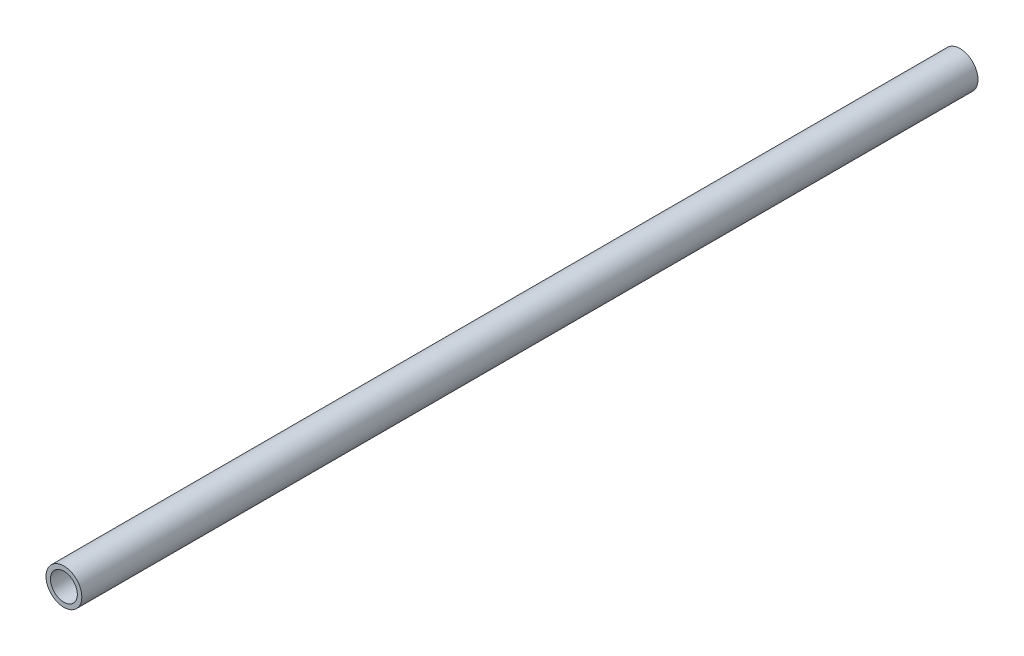
ISO-10303-21;
HEADER;
FILE_DESCRIPTION(('STEP AP214'),'2;1');
FILE_NAME('part.step','',(''),(''),'','','');
FILE_SCHEMA(('AUTOMOTIVE_DESIGN { 1 0 10303 214 1 1 1 1 }'));
ENDSEC;
DATA;
#1=APPLICATION_CONTEXT('core data for automotive mechanical design processes');
#2=APPLICATION_PROTOCOL_DEFINITION('international standard','automotive_design',2000,#1);
#3=PRODUCT_CONTEXT('',#1,'mechanical');
#4=PRODUCT('Part','Part','',(#3));
#5=PRODUCT_RELATED_PRODUCT_CATEGORY('part','',(#4));
#6=PRODUCT_DEFINITION_FORMATION('','',#4);
#7=PRODUCT_DEFINITION_CONTEXT('part definition',#1,'design');
#8=PRODUCT_DEFINITION('design','',#6,#7);
#9=PRODUCT_DEFINITION_SHAPE('','',#8);
#10=(LENGTH_UNIT() NAMED_UNIT(*) SI_UNIT(.MILLI.,.METRE.));
#11=(NAMED_UNIT(*) PLANE_ANGLE_UNIT() SI_UNIT($,.RADIAN.));
#12=(NAMED_UNIT(*) SI_UNIT($,.STERADIAN.) SOLID_ANGLE_UNIT());
#13=UNCERTAINTY_MEASURE_WITH_UNIT(LENGTH_MEASURE(1.E-05),#10,'distance_accuracy_value','');
#14=(GEOMETRIC_REPRESENTATION_CONTEXT(3) GLOBAL_UNCERTAINTY_ASSIGNED_CONTEXT((#13)) GLOBAL_UNIT_ASSIGNED_CONTEXT((#10,
#11,#12)) REPRESENTATION_CONTEXT('',''));
#15=CARTESIAN_POINT('',(0.,0.,0.));
#16=DIRECTION('',(0.,0.,1.));
#17=DIRECTION('',(1.,0.,0.));
#18=AXIS2_PLACEMENT_3D('',#15,#16,#17);
#19=CARTESIAN_POINT('',(0.,0.,635.));
#20=DIRECTION('',(0.,0.,1.));
#21=DIRECTION('',(1.,0.,0.));
#22=AXIS2_PLACEMENT_3D('',#19,#20,#21);
#23=PLANE('',#22);
#24=CARTESIAN_POINT('',(0.,0.,635.));
#25=DIRECTION('',(0.,0.,1.));
#26=DIRECTION('',(1.,0.,0.));
#27=AXIS2_PLACEMENT_3D('',#24,#25,#26);
#28=CIRCLE('',#27,12.7);
#29=CARTESIAN_POINT('',(12.7,0.,635.));
#30=VERTEX_POINT('',#29);
#31=EDGE_CURVE('E10',#30,#30,#28,.T.);
#32=ORIENTED_EDGE('',*,*,#31,.T.);
#33=EDGE_LOOP('',(#32));
#34=FACE_BOUND('',#33,.T.);
#35=CARTESIAN_POINT('',(0.,0.,635.));
#36=DIRECTION('',(0.,0.,1.));
#37=DIRECTION('',(1.,0.,0.));
#38=AXIS2_PLACEMENT_3D('',#35,#36,#37);
#39=CIRCLE('',#38,9.525);
#40=CARTESIAN_POINT('',(9.525,0.,635.));
#41=VERTEX_POINT('',#40);
#42=EDGE_CURVE('E48',#41,#41,#39,.T.);
#43=ORIENTED_EDGE('',*,*,#42,.F.);
#44=EDGE_LOOP('',(#43));
#45=FACE_BOUND('',#44,.T.);
#46=ADVANCED_FACE('F37',(#34,#45),#23,.T.);
#47=CARTESIAN_POINT('',(0.,0.,0.));
#48=DIRECTION('',(0.,0.,1.));
#49=DIRECTION('',(1.,0.,0.));
#50=AXIS2_PLACEMENT_3D('',#47,#48,#49);
#51=PLANE('',#50);
#52=CARTESIAN_POINT('',(0.,0.,0.));
#53=DIRECTION('',(0.,0.,1.));
#54=DIRECTION('',(1.,0.,0.));
#55=AXIS2_PLACEMENT_3D('',#52,#53,#54);
#56=CIRCLE('',#55,12.7);
#57=CARTESIAN_POINT('',(12.7,0.,0.));
#58=VERTEX_POINT('',#57);
#59=EDGE_CURVE('E41',#58,#58,#56,.T.);
#60=ORIENTED_EDGE('',*,*,#59,.F.);
#61=EDGE_LOOP('',(#60));
#62=FACE_BOUND('',#61,.T.);
#63=CARTESIAN_POINT('',(0.,0.,0.));
#64=DIRECTION('',(0.,0.,1.));
#65=DIRECTION('',(1.,0.,0.));
#66=AXIS2_PLACEMENT_3D('',#63,#64,#65);
#67=CIRCLE('',#66,9.525);
#68=CARTESIAN_POINT('',(9.525,0.,0.));
#69=VERTEX_POINT('',#68);
#70=EDGE_CURVE('E50',#69,#69,#67,.T.);
#71=ORIENTED_EDGE('',*,*,#70,.T.);
#72=EDGE_LOOP('',(#71));
#73=FACE_BOUND('',#72,.T.);
#74=ADVANCED_FACE('F60',(#62,#73),#51,.F.);
#75=CARTESIAN_POINT('',(0.,0.,635.));
#76=DIRECTION('',(0.,0.,-1.));
#77=DIRECTION('',(-1.,0.,0.));
#78=AXIS2_PLACEMENT_3D('',#75,#76,#77);
#79=CYLINDRICAL_SURFACE('',#78,12.7);
#80=ORIENTED_EDGE('',*,*,#31,.F.);
#81=EDGE_LOOP('',(#80));
#82=FACE_BOUND('',#81,.T.);
#83=ORIENTED_EDGE('',*,*,#59,.T.);
#84=EDGE_LOOP('',(#83));
#85=FACE_BOUND('',#84,.T.);
#86=ADVANCED_FACE('F39',(#82,#85),#79,.T.);
#87=CARTESIAN_POINT('',(0.,0.,635.));
#88=DIRECTION('',(0.,0.,-1.));
#89=DIRECTION('',(-1.,0.,0.));
#90=AXIS2_PLACEMENT_3D('',#87,#88,#89);
#91=CYLINDRICAL_SURFACE('',#90,9.525);
#92=ORIENTED_EDGE('',*,*,#42,.T.);
#93=EDGE_LOOP('',(#92));
#94=FACE_BOUND('',#93,.T.);
#95=ORIENTED_EDGE('',*,*,#70,.F.);
#96=EDGE_LOOP('',(#95));
#97=FACE_BOUND('',#96,.T.);
#98=ADVANCED_FACE('F56',(#94,#97),#91,.F.);
#99=CLOSED_SHELL('',(#46,#74,#86,#98));
#100=MANIFOLD_SOLID_BREP('B2',#99);
#101=ADVANCED_BREP_SHAPE_REPRESENTATION('',(#18,#100),#14);
#102=SHAPE_DEFINITION_REPRESENTATION(#9,#101);
ENDSEC;
END-ISO-10303-21;
